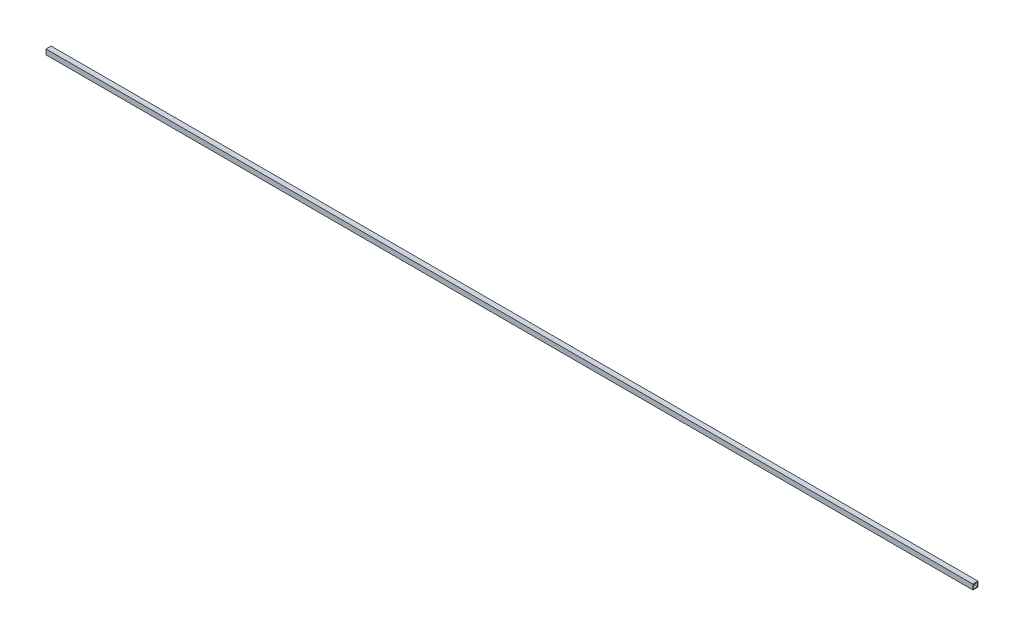
ISO-10303-21;
HEADER;
FILE_DESCRIPTION(('STEP AP214'),'2;1');
FILE_NAME('part.step','',(''),(''),'','','');
FILE_SCHEMA(('AUTOMOTIVE_DESIGN { 1 0 10303 214 1 1 1 1 }'));
ENDSEC;
DATA;
#1=APPLICATION_CONTEXT('core data for automotive mechanical design processes');
#2=APPLICATION_PROTOCOL_DEFINITION('international standard','automotive_design',2000,#1);
#3=PRODUCT_CONTEXT('',#1,'mechanical');
#4=PRODUCT('Part','Part','',(#3));
#5=PRODUCT_RELATED_PRODUCT_CATEGORY('part','',(#4));
#6=PRODUCT_DEFINITION_FORMATION('','',#4);
#7=PRODUCT_DEFINITION_CONTEXT('part definition',#1,'design');
#8=PRODUCT_DEFINITION('design','',#6,#7);
#9=PRODUCT_DEFINITION_SHAPE('','',#8);
#10=(LENGTH_UNIT() NAMED_UNIT(*) SI_UNIT(.MILLI.,.METRE.));
#11=(NAMED_UNIT(*) PLANE_ANGLE_UNIT() SI_UNIT($,.RADIAN.));
#12=(NAMED_UNIT(*) SI_UNIT($,.STERADIAN.) SOLID_ANGLE_UNIT());
#13=UNCERTAINTY_MEASURE_WITH_UNIT(LENGTH_MEASURE(1.E-05),#10,'distance_accuracy_value','');
#14=(GEOMETRIC_REPRESENTATION_CONTEXT(3) GLOBAL_UNCERTAINTY_ASSIGNED_CONTEXT((#13)) GLOBAL_UNIT_ASSIGNED_CONTEXT((#10,
#11,#12)) REPRESENTATION_CONTEXT('',''));
#15=CARTESIAN_POINT('',(0.,0.,0.));
#16=DIRECTION('',(0.,0.,1.));
#17=DIRECTION('',(1.,0.,0.));
#18=AXIS2_PLACEMENT_3D('',#15,#16,#17);
#19=CARTESIAN_POINT('',(9206.23,25.4,25.4));
#20=DIRECTION('',(0.,-1.,0.));
#21=DIRECTION('',(0.,0.,-1.));
#22=AXIS2_PLACEMENT_3D('',#19,#20,#21);
#23=PLANE('',#22);
#24=DIRECTION('',(0.,0.,1.));
#25=VECTOR('',#24,1.);
#26=CARTESIAN_POINT('',(0.,25.4,25.4));
#27=LINE('',#26,#25);
#28=CARTESIAN_POINT('',(0.,25.4,-25.4));
#29=VERTEX_POINT('',#28);
#30=CARTESIAN_POINT('',(0.,25.4,25.4));
#31=VERTEX_POINT('',#30);
#32=EDGE_CURVE('E171',#29,#31,#27,.T.);
#33=ORIENTED_EDGE('',*,*,#32,.T.);
#34=DIRECTION('',(-1.,0.,0.));
#35=VECTOR('',#34,1.);
#36=CARTESIAN_POINT('',(9206.23,25.4,25.4));
#37=LINE('',#36,#35);
#38=CARTESIAN_POINT('',(9206.23,25.4,25.4));
#39=VERTEX_POINT('',#38);
#40=EDGE_CURVE('E12',#39,#31,#37,.T.);
#41=ORIENTED_EDGE('',*,*,#40,.F.);
#42=DIRECTION('',(0.,0.,1.));
#43=VECTOR('',#42,1.);
#44=CARTESIAN_POINT('',(9206.23,25.4,25.4));
#45=LINE('',#44,#43);
#46=CARTESIAN_POINT('',(9206.23,25.4,-25.4));
#47=VERTEX_POINT('',#46);
#48=EDGE_CURVE('E137',#47,#39,#45,.T.);
#49=ORIENTED_EDGE('',*,*,#48,.F.);
#50=DIRECTION('',(-1.,0.,0.));
#51=VECTOR('',#50,1.);
#52=CARTESIAN_POINT('',(9206.23,25.4,-25.4));
#53=LINE('',#52,#51);
#54=EDGE_CURVE('E182',#47,#29,#53,.T.);
#55=ORIENTED_EDGE('',*,*,#54,.T.);
#56=EDGE_LOOP('',(#33,#41,#49,#55));
#57=FACE_BOUND('',#56,.T.);
#58=ADVANCED_FACE('F55',(#57),#23,.F.);
#59=CARTESIAN_POINT('',(9206.23,25.4,25.4));
#60=DIRECTION('',(0.,0.,-1.));
#61=DIRECTION('',(-1.,0.,0.));
#62=AXIS2_PLACEMENT_3D('',#59,#60,#61);
#63=PLANE('',#62);
#64=DIRECTION('',(0.,-1.,0.));
#65=VECTOR('',#64,1.);
#66=CARTESIAN_POINT('',(0.,25.4,25.4));
#67=LINE('',#66,#65);
#68=CARTESIAN_POINT('',(0.,-25.4,25.4));
#69=VERTEX_POINT('',#68);
#70=EDGE_CURVE('E143',#31,#69,#67,.T.);
#71=ORIENTED_EDGE('',*,*,#70,.T.);
#72=DIRECTION('',(-1.,0.,0.));
#73=VECTOR('',#72,1.);
#74=CARTESIAN_POINT('',(9206.23,-25.4,25.4));
#75=LINE('',#74,#73);
#76=CARTESIAN_POINT('',(9206.23,-25.4,25.4));
#77=VERTEX_POINT('',#76);
#78=EDGE_CURVE('E66',#77,#69,#75,.T.);
#79=ORIENTED_EDGE('',*,*,#78,.F.);
#80=DIRECTION('',(0.,-1.,0.));
#81=VECTOR('',#80,1.);
#82=CARTESIAN_POINT('',(9206.23,25.4,25.4));
#83=LINE('',#82,#81);
#84=EDGE_CURVE('E131',#39,#77,#83,.T.);
#85=ORIENTED_EDGE('',*,*,#84,.F.);
#86=ORIENTED_EDGE('',*,*,#40,.T.);
#87=EDGE_LOOP('',(#71,#79,#85,#86));
#88=FACE_BOUND('',#87,.T.);
#89=ADVANCED_FACE('F142',(#88),#63,.F.);
#90=CARTESIAN_POINT('',(9206.23,-25.4,-25.4));
#91=DIRECTION('',(0.,1.,0.));
#92=DIRECTION('',(0.,0.,1.));
#93=AXIS2_PLACEMENT_3D('',#90,#91,#92);
#94=PLANE('',#93);
#95=DIRECTION('',(0.,0.,-1.));
#96=VECTOR('',#95,1.);
#97=CARTESIAN_POINT('',(0.,-25.4,-25.4));
#98=LINE('',#97,#96);
#99=CARTESIAN_POINT('',(0.,-25.4,-25.4));
#100=VERTEX_POINT('',#99);
#101=EDGE_CURVE('E104',#69,#100,#98,.T.);
#102=ORIENTED_EDGE('',*,*,#101,.T.);
#103=DIRECTION('',(-1.,0.,0.));
#104=VECTOR('',#103,1.);
#105=CARTESIAN_POINT('',(9206.23,-25.4,-25.4));
#106=LINE('',#105,#104);
#107=CARTESIAN_POINT('',(9206.23,-25.4,-25.4));
#108=VERTEX_POINT('',#107);
#109=EDGE_CURVE('E145',#108,#100,#106,.T.);
#110=ORIENTED_EDGE('',*,*,#109,.F.);
#111=DIRECTION('',(0.,0.,-1.));
#112=VECTOR('',#111,1.);
#113=CARTESIAN_POINT('',(9206.23,-25.4,-25.4));
#114=LINE('',#113,#112);
#115=EDGE_CURVE('E135',#77,#108,#114,.T.);
#116=ORIENTED_EDGE('',*,*,#115,.F.);
#117=ORIENTED_EDGE('',*,*,#78,.T.);
#118=EDGE_LOOP('',(#102,#110,#116,#117));
#119=FACE_BOUND('',#118,.T.);
#120=ADVANCED_FACE('F147',(#119),#94,.F.);
#121=CARTESIAN_POINT('',(9206.23,19.05,19.05));
#122=DIRECTION('',(0.,0.,-1.));
#123=DIRECTION('',(-1.,0.,0.));
#124=AXIS2_PLACEMENT_3D('',#121,#122,#123);
#125=PLANE('',#124);
#126=DIRECTION('',(0.,-1.,0.));
#127=VECTOR('',#126,1.);
#128=CARTESIAN_POINT('',(0.,19.05,19.05));
#129=LINE('',#128,#127);
#130=CARTESIAN_POINT('',(0.,19.05,19.05));
#131=VERTEX_POINT('',#130);
#132=CARTESIAN_POINT('',(0.,-19.05,19.05));
#133=VERTEX_POINT('',#132);
#134=EDGE_CURVE('E155',#131,#133,#129,.T.);
#135=ORIENTED_EDGE('',*,*,#134,.F.);
#136=DIRECTION('',(-1.,0.,0.));
#137=VECTOR('',#136,1.);
#138=CARTESIAN_POINT('',(9206.23,19.05,19.05));
#139=LINE('',#138,#137);
#140=CARTESIAN_POINT('',(9206.23,19.05,19.05));
#141=VERTEX_POINT('',#140);
#142=EDGE_CURVE('E59',#141,#131,#139,.T.);
#143=ORIENTED_EDGE('',*,*,#142,.F.);
#144=DIRECTION('',(0.,-1.,0.));
#145=VECTOR('',#144,1.);
#146=CARTESIAN_POINT('',(9206.23,19.05,19.05));
#147=LINE('',#146,#145);
#148=CARTESIAN_POINT('',(9206.23,-19.05,19.05));
#149=VERTEX_POINT('',#148);
#150=EDGE_CURVE('E181',#141,#149,#147,.T.);
#151=ORIENTED_EDGE('',*,*,#150,.T.);
#152=DIRECTION('',(-1.,0.,0.));
#153=VECTOR('',#152,1.);
#154=CARTESIAN_POINT('',(9206.23,-19.05,19.05));
#155=LINE('',#154,#153);
#156=EDGE_CURVE('E151',#149,#133,#155,.T.);
#157=ORIENTED_EDGE('',*,*,#156,.T.);
#158=EDGE_LOOP('',(#135,#143,#151,#157));
#159=FACE_BOUND('',#158,.T.);
#160=ADVANCED_FACE('F57',(#159),#125,.T.);
#161=CARTESIAN_POINT('',(9206.23,19.05,19.05));
#162=DIRECTION('',(0.,-1.,0.));
#163=DIRECTION('',(0.,0.,-1.));
#164=AXIS2_PLACEMENT_3D('',#161,#162,#163);
#165=PLANE('',#164);
#166=DIRECTION('',(0.,0.,1.));
#167=VECTOR('',#166,1.);
#168=CARTESIAN_POINT('',(0.,19.05,19.05));
#169=LINE('',#168,#167);
#170=CARTESIAN_POINT('',(0.,19.05,-19.05));
#171=VERTEX_POINT('',#170);
#172=EDGE_CURVE('E159',#171,#131,#169,.T.);
#173=ORIENTED_EDGE('',*,*,#172,.F.);
#174=DIRECTION('',(-1.,0.,0.));
#175=VECTOR('',#174,1.);
#176=CARTESIAN_POINT('',(9206.23,19.05,-19.05));
#177=LINE('',#176,#175);
#178=CARTESIAN_POINT('',(9206.23,19.05,-19.05));
#179=VERTEX_POINT('',#178);
#180=EDGE_CURVE('E191',#179,#171,#177,.T.);
#181=ORIENTED_EDGE('',*,*,#180,.F.);
#182=DIRECTION('',(0.,0.,1.));
#183=VECTOR('',#182,1.);
#184=CARTESIAN_POINT('',(9206.23,19.05,19.05));
#185=LINE('',#184,#183);
#186=EDGE_CURVE('E202',#179,#141,#185,.T.);
#187=ORIENTED_EDGE('',*,*,#186,.T.);
#188=ORIENTED_EDGE('',*,*,#142,.T.);
#189=EDGE_LOOP('',(#173,#181,#187,#188));
#190=FACE_BOUND('',#189,.T.);
#191=ADVANCED_FACE('F200',(#190),#165,.T.);
#192=CARTESIAN_POINT('',(9206.23,-19.05,-19.05));
#193=DIRECTION('',(0.,0.,1.));
#194=DIRECTION('',(1.,0.,0.));
#195=AXIS2_PLACEMENT_3D('',#192,#193,#194);
#196=PLANE('',#195);
#197=DIRECTION('',(0.,1.,0.));
#198=VECTOR('',#197,1.);
#199=CARTESIAN_POINT('',(0.,-19.05,-19.05));
#200=LINE('',#199,#198);
#201=CARTESIAN_POINT('',(0.,-19.05,-19.05));
#202=VERTEX_POINT('',#201);
#203=EDGE_CURVE('E163',#202,#171,#200,.T.);
#204=ORIENTED_EDGE('',*,*,#203,.F.);
#205=DIRECTION('',(-1.,0.,0.));
#206=VECTOR('',#205,1.);
#207=CARTESIAN_POINT('',(9206.23,-19.05,-19.05));
#208=LINE('',#207,#206);
#209=CARTESIAN_POINT('',(9206.23,-19.05,-19.05));
#210=VERTEX_POINT('',#209);
#211=EDGE_CURVE('E189',#210,#202,#208,.T.);
#212=ORIENTED_EDGE('',*,*,#211,.F.);
#213=DIRECTION('',(0.,1.,0.));
#214=VECTOR('',#213,1.);
#215=CARTESIAN_POINT('',(9206.23,-19.05,-19.05));
#216=LINE('',#215,#214);
#217=EDGE_CURVE('E209',#210,#179,#216,.T.);
#218=ORIENTED_EDGE('',*,*,#217,.T.);
#219=ORIENTED_EDGE('',*,*,#180,.T.);
#220=EDGE_LOOP('',(#204,#212,#218,#219));
#221=FACE_BOUND('',#220,.T.);
#222=ADVANCED_FACE('F207',(#221),#196,.T.);
#223=CARTESIAN_POINT('',(9206.23,-19.05,-19.05));
#224=DIRECTION('',(0.,1.,0.));
#225=DIRECTION('',(0.,0.,1.));
#226=AXIS2_PLACEMENT_3D('',#223,#224,#225);
#227=PLANE('',#226);
#228=DIRECTION('',(0.,0.,-1.));
#229=VECTOR('',#228,1.);
#230=CARTESIAN_POINT('',(0.,-19.05,-19.05));
#231=LINE('',#230,#229);
#232=EDGE_CURVE('E167',#133,#202,#231,.T.);
#233=ORIENTED_EDGE('',*,*,#232,.F.);
#234=ORIENTED_EDGE('',*,*,#156,.F.);
#235=DIRECTION('',(0.,0.,-1.));
#236=VECTOR('',#235,1.);
#237=CARTESIAN_POINT('',(9206.23,-19.05,-19.05));
#238=LINE('',#237,#236);
#239=EDGE_CURVE('E214',#149,#210,#238,.T.);
#240=ORIENTED_EDGE('',*,*,#239,.T.);
#241=ORIENTED_EDGE('',*,*,#211,.T.);
#242=EDGE_LOOP('',(#233,#234,#240,#241));
#243=FACE_BOUND('',#242,.T.);
#244=ADVANCED_FACE('F217',(#243),#227,.T.);
#245=CARTESIAN_POINT('',(9206.23,-25.4,-25.4));
#246=DIRECTION('',(0.,0.,1.));
#247=DIRECTION('',(0.,-1.,0.));
#248=AXIS2_PLACEMENT_3D('',#245,#246,#247);
#249=PLANE('',#248);
#250=DIRECTION('',(0.,1.,0.));
#251=VECTOR('',#250,1.);
#252=CARTESIAN_POINT('',(0.,-25.4,-25.4));
#253=LINE('',#252,#251);
#254=EDGE_CURVE('E110',#100,#29,#253,.T.);
#255=ORIENTED_EDGE('',*,*,#254,.T.);
#256=ORIENTED_EDGE('',*,*,#54,.F.);
#257=DIRECTION('',(0.,1.,0.));
#258=VECTOR('',#257,1.);
#259=CARTESIAN_POINT('',(9206.23,-25.4,-25.4));
#260=LINE('',#259,#258);
#261=EDGE_CURVE('E75',#108,#47,#260,.T.);
#262=ORIENTED_EDGE('',*,*,#261,.F.);
#263=ORIENTED_EDGE('',*,*,#109,.T.);
#264=EDGE_LOOP('',(#255,#256,#262,#263));
#265=FACE_BOUND('',#264,.T.);
#266=ADVANCED_FACE('F226',(#265),#249,.F.);
#267=CARTESIAN_POINT('',(9206.23,0.,0.));
#268=DIRECTION('',(1.,0.,0.));
#269=DIRECTION('',(0.,0.,-1.));
#270=AXIS2_PLACEMENT_3D('',#267,#268,#269);
#271=PLANE('',#270);
#272=ORIENTED_EDGE('',*,*,#150,.F.);
#273=ORIENTED_EDGE('',*,*,#186,.F.);
#274=ORIENTED_EDGE('',*,*,#217,.F.);
#275=ORIENTED_EDGE('',*,*,#239,.F.);
#276=EDGE_LOOP('',(#272,#273,#274,#275));
#277=FACE_BOUND('',#276,.T.);
#278=ORIENTED_EDGE('',*,*,#48,.T.);
#279=ORIENTED_EDGE('',*,*,#84,.T.);
#280=ORIENTED_EDGE('',*,*,#115,.T.);
#281=ORIENTED_EDGE('',*,*,#261,.T.);
#282=EDGE_LOOP('',(#278,#279,#280,#281));
#283=FACE_BOUND('',#282,.T.);
#284=ADVANCED_FACE('F133',(#277,#283),#271,.T.);
#285=CARTESIAN_POINT('',(0.,0.,0.));
#286=DIRECTION('',(1.,0.,0.));
#287=DIRECTION('',(0.,0.,-1.));
#288=AXIS2_PLACEMENT_3D('',#285,#286,#287);
#289=PLANE('',#288);
#290=ORIENTED_EDGE('',*,*,#134,.T.);
#291=ORIENTED_EDGE('',*,*,#232,.T.);
#292=ORIENTED_EDGE('',*,*,#203,.T.);
#293=ORIENTED_EDGE('',*,*,#172,.T.);
#294=EDGE_LOOP('',(#290,#291,#292,#293));
#295=FACE_BOUND('',#294,.T.);
#296=ORIENTED_EDGE('',*,*,#32,.F.);
#297=ORIENTED_EDGE('',*,*,#254,.F.);
#298=ORIENTED_EDGE('',*,*,#101,.F.);
#299=ORIENTED_EDGE('',*,*,#70,.F.);
#300=EDGE_LOOP('',(#296,#297,#298,#299));
#301=FACE_BOUND('',#300,.T.);
#302=ADVANCED_FACE('F205',(#295,#301),#289,.F.);
#303=CLOSED_SHELL('',(#58,#89,#120,#160,#191,#222,#244,#266,#284,#302));
#304=MANIFOLD_SOLID_BREP('B2',#303);
#305=ADVANCED_BREP_SHAPE_REPRESENTATION('',(#18,#304),#14);
#306=SHAPE_DEFINITION_REPRESENTATION(#9,#305);
ENDSEC;
END-ISO-10303-21;
